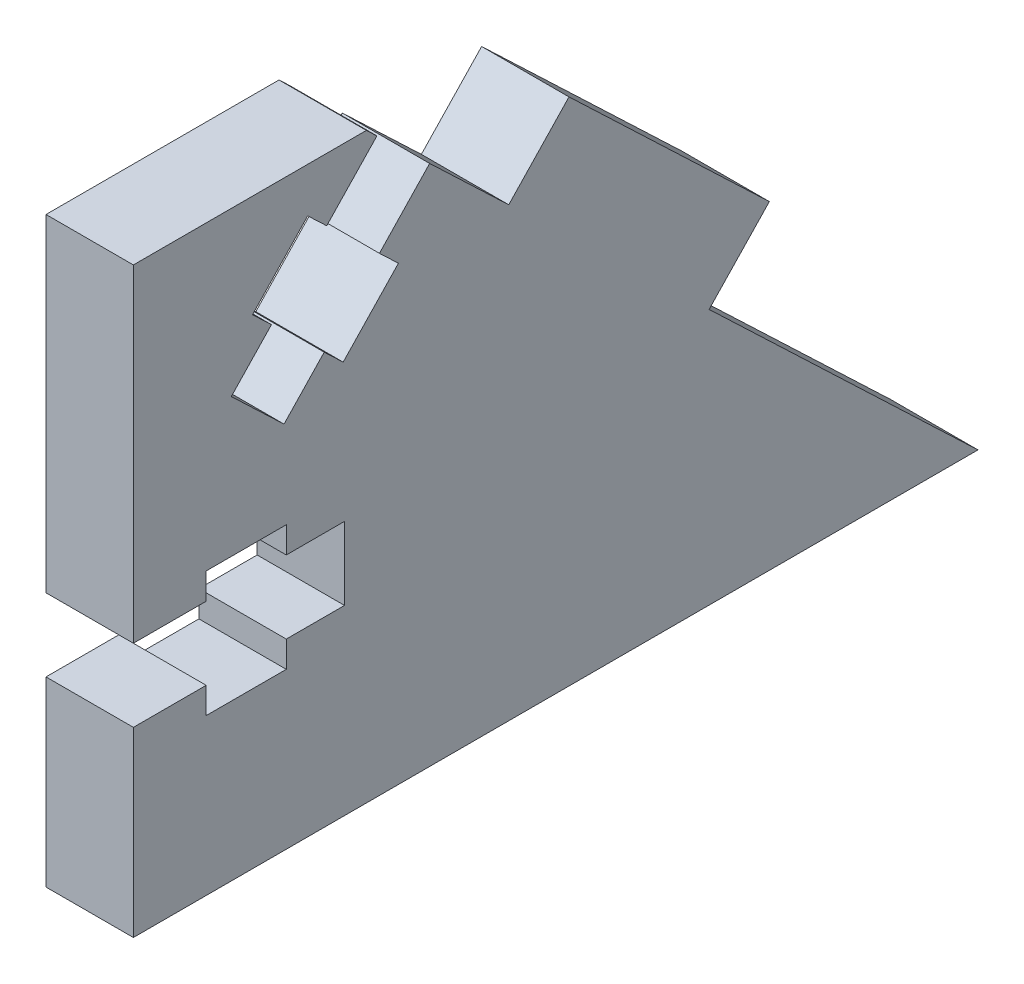
ISO-10303-21;
HEADER;
FILE_DESCRIPTION(('STEP AP214'),'2;1');
FILE_NAME('part.step','',(''),(''),'','','');
FILE_SCHEMA(('AUTOMOTIVE_DESIGN { 1 0 10303 214 1 1 1 1 }'));
ENDSEC;
DATA;
#1=APPLICATION_CONTEXT('core data for automotive mechanical design processes');
#2=APPLICATION_PROTOCOL_DEFINITION('international standard','automotive_design',2000,#1);
#3=PRODUCT_CONTEXT('',#1,'mechanical');
#4=PRODUCT('Part','Part','',(#3));
#5=PRODUCT_RELATED_PRODUCT_CATEGORY('part','',(#4));
#6=PRODUCT_DEFINITION_FORMATION('','',#4);
#7=PRODUCT_DEFINITION_CONTEXT('part definition',#1,'design');
#8=PRODUCT_DEFINITION('design','',#6,#7);
#9=PRODUCT_DEFINITION_SHAPE('','',#8);
#10=(LENGTH_UNIT() NAMED_UNIT(*) SI_UNIT(.MILLI.,.METRE.));
#11=(NAMED_UNIT(*) PLANE_ANGLE_UNIT() SI_UNIT($,.RADIAN.));
#12=(NAMED_UNIT(*) SI_UNIT($,.STERADIAN.) SOLID_ANGLE_UNIT());
#13=UNCERTAINTY_MEASURE_WITH_UNIT(LENGTH_MEASURE(1.E-05),#10,'distance_accuracy_value','');
#14=(GEOMETRIC_REPRESENTATION_CONTEXT(3) GLOBAL_UNCERTAINTY_ASSIGNED_CONTEXT((#13)) GLOBAL_UNIT_ASSIGNED_CONTEXT((#10,
#11,#12)) REPRESENTATION_CONTEXT('',''));
#15=CARTESIAN_POINT('',(0.,0.,0.));
#16=DIRECTION('',(0.,0.,1.));
#17=DIRECTION('',(1.,0.,0.));
#18=AXIS2_PLACEMENT_3D('',#15,#16,#17);
#19=CARTESIAN_POINT('',(6.,0.,0.));
#20=DIRECTION('',(-1.,0.,0.));
#21=DIRECTION('',(0.,0.,1.));
#22=AXIS2_PLACEMENT_3D('',#19,#20,#21);
#23=PLANE('',#22);
#24=DIRECTION('',(0.,-0.724137931034483,0.689655172413792));
#25=VECTOR('',#24,1.);
#26=CARTESIAN_POINT('',(6.,6.8965517241379,7.24137931034481));
#27=LINE('',#26,#25);
#28=CARTESIAN_POINT('',(6.,35.8620689655172,-20.3448275862069));
#29=VERTEX_POINT('',#28);
#30=CARTESIAN_POINT('',(6.,32.2413793103448,-16.8965517241379));
#31=VERTEX_POINT('',#30);
#32=EDGE_CURVE('E248',#29,#31,#27,.T.);
#33=ORIENTED_EDGE('',*,*,#32,.T.);
#34=DIRECTION('',(0.,-0.689655172413792,-0.724137931034484));
#35=VECTOR('',#34,1.);
#36=CARTESIAN_POINT('',(6.,25.3448275862069,-24.1379310344827));
#37=LINE('',#36,#35);
#38=CARTESIAN_POINT('',(6.,31.,-18.2));
#39=VERTEX_POINT('',#38);
#40=EDGE_CURVE('E263',#31,#39,#37,.T.);
#41=ORIENTED_EDGE('',*,*,#40,.T.);
#42=DIRECTION('',(0.,-0.724137931034483,0.689655172413793));
#43=VECTOR('',#42,1.);
#44=CARTESIAN_POINT('',(6.,5.6551724137931,5.93793103448276));
#45=LINE('',#44,#43);
#46=CARTESIAN_POINT('',(6.,27.0172413793103,-14.4068965517241));
#47=VERTEX_POINT('',#46);
#48=EDGE_CURVE('E443',#39,#47,#45,.T.);
#49=ORIENTED_EDGE('',*,*,#48,.T.);
#50=DIRECTION('',(0.,0.689655172413794,0.724137931034482));
#51=VECTOR('',#50,1.);
#52=CARTESIAN_POINT('',(6.,21.3620689655172,-20.3448275862069));
#53=LINE('',#52,#51);
#54=CARTESIAN_POINT('',(6.,28.2586206896552,-13.1034482758621));
#55=VERTEX_POINT('',#54);
#56=EDGE_CURVE('E446',#47,#55,#53,.T.);
#57=ORIENTED_EDGE('',*,*,#56,.T.);
#58=DIRECTION('',(0.,-0.724137931034483,0.689655172413793));
#59=VECTOR('',#58,1.);
#60=CARTESIAN_POINT('',(6.,6.89655172413792,7.24137931034482));
#61=LINE('',#60,#59);
#62=CARTESIAN_POINT('',(6.,25.3620689655172,-10.3448275862069));
#63=VERTEX_POINT('',#62);
#64=EDGE_CURVE('E449',#55,#63,#61,.T.);
#65=ORIENTED_EDGE('',*,*,#64,.T.);
#66=DIRECTION('',(0.,-0.689655172413793,-0.724137931034483));
#67=VECTOR('',#66,1.);
#68=CARTESIAN_POINT('',(6.,18.4655172413793,-17.5862068965517));
#69=LINE('',#68,#67);
#70=CARTESIAN_POINT('',(6.,28.8103448275862,-6.72413793103447));
#71=VERTEX_POINT('',#70);
#72=EDGE_CURVE('E452',#71,#63,#69,.T.);
#73=ORIENTED_EDGE('',*,*,#72,.F.);
#74=DIRECTION('',(0.,-0.724137931034483,0.689655172413793));
#75=VECTOR('',#74,1.);
#76=CARTESIAN_POINT('',(6.,10.3448275862069,10.8620689655172));
#77=LINE('',#76,#75);
#78=CARTESIAN_POINT('',(6.,31.7068965517241,-9.48275862068965));
#79=VERTEX_POINT('',#78);
#80=EDGE_CURVE('E455',#79,#71,#77,.T.);
#81=ORIENTED_EDGE('',*,*,#80,.F.);
#82=DIRECTION('',(0.,-0.689655172413793,-0.724137931034483));
#83=VECTOR('',#82,1.);
#84=CARTESIAN_POINT('',(6.,21.3620689655173,-20.3448275862069));
#85=LINE('',#84,#83);
#86=CARTESIAN_POINT('',(6.,32.948275862069,-8.17931034482758));
#87=VERTEX_POINT('',#86);
#88=EDGE_CURVE('E458',#87,#79,#85,.T.);
#89=ORIENTED_EDGE('',*,*,#88,.F.);
#90=DIRECTION('',(0.,-0.724137931034483,0.689655172413793));
#91=VECTOR('',#90,1.);
#92=CARTESIAN_POINT('',(6.,11.5862068965517,12.1655172413793));
#93=LINE('',#92,#91);
#94=CARTESIAN_POINT('',(6.,36.9310344827586,-11.9724137931034));
#95=VERTEX_POINT('',#94);
#96=EDGE_CURVE('E461',#95,#87,#93,.T.);
#97=ORIENTED_EDGE('',*,*,#96,.F.);
#98=DIRECTION('',(0.,0.689655172413793,0.724137931034483));
#99=VECTOR('',#98,1.);
#100=CARTESIAN_POINT('',(6.,25.3448275862069,-24.1379310344828));
#101=LINE('',#100,#99);
#102=CARTESIAN_POINT('',(6.,35.6896551724138,-13.2758620689655));
#103=VERTEX_POINT('',#102);
#104=EDGE_CURVE('E464',#103,#95,#101,.T.);
#105=ORIENTED_EDGE('',*,*,#104,.F.);
#106=DIRECTION('',(0.,-0.724137931034483,0.689655172413793));
#107=VECTOR('',#106,1.);
#108=CARTESIAN_POINT('',(6.,10.3448275862069,10.8620689655172));
#109=LINE('',#108,#107);
#110=CARTESIAN_POINT('',(6.,39.3103448275862,-16.7241379310345));
#111=VERTEX_POINT('',#110);
#112=EDGE_CURVE('E467',#111,#103,#109,.T.);
#113=ORIENTED_EDGE('',*,*,#112,.F.);
#114=DIRECTION('',(0.,0.689655172413793,0.724137931034483));
#115=VECTOR('',#114,1.);
#116=CARTESIAN_POINT('',(6.,40.,-16.));
#117=LINE('',#116,#115);
#118=CARTESIAN_POINT('',(6.,40.,-16.));
#119=VERTEX_POINT('',#118);
#120=EDGE_CURVE('E326',#111,#119,#117,.T.);
#121=ORIENTED_EDGE('',*,*,#120,.T.);
#122=DIRECTION('',(0.,0.,1.));
#123=VECTOR('',#122,1.);
#124=CARTESIAN_POINT('',(6.,40.,0.));
#125=LINE('',#124,#123);
#126=CARTESIAN_POINT('',(6.,40.,0.));
#127=VERTEX_POINT('',#126);
#128=EDGE_CURVE('E322',#119,#127,#125,.T.);
#129=ORIENTED_EDGE('',*,*,#128,.T.);
#130=DIRECTION('',(0.,-1.,0.));
#131=VECTOR('',#130,1.);
#132=CARTESIAN_POINT('',(6.,0.,0.));
#133=LINE('',#132,#131);
#134=CARTESIAN_POINT('',(6.,17.5,0.));
#135=VERTEX_POINT('',#134);
#136=EDGE_CURVE('E286',#127,#135,#133,.T.);
#137=ORIENTED_EDGE('',*,*,#136,.T.);
#138=DIRECTION('',(0.,0.,-1.));
#139=VECTOR('',#138,1.);
#140=CARTESIAN_POINT('',(6.,17.5,0.));
#141=LINE('',#140,#139);
#142=CARTESIAN_POINT('',(6.,17.5,-5.));
#143=VERTEX_POINT('',#142);
#144=EDGE_CURVE('E393',#135,#143,#141,.T.);
#145=ORIENTED_EDGE('',*,*,#144,.T.);
#146=DIRECTION('',(0.,1.,0.));
#147=VECTOR('',#146,1.);
#148=CARTESIAN_POINT('',(6.,0.,-4.99999999999999));
#149=LINE('',#148,#147);
#150=CARTESIAN_POINT('',(6.,19.3,-5.));
#151=VERTEX_POINT('',#150);
#152=EDGE_CURVE('E362',#143,#151,#149,.T.);
#153=ORIENTED_EDGE('',*,*,#152,.T.);
#154=DIRECTION('',(0.,0.,-1.));
#155=VECTOR('',#154,1.);
#156=CARTESIAN_POINT('',(6.,19.3,0.));
#157=LINE('',#156,#155);
#158=CARTESIAN_POINT('',(6.,19.3,-10.5));
#159=VERTEX_POINT('',#158);
#160=EDGE_CURVE('E366',#151,#159,#157,.T.);
#161=ORIENTED_EDGE('',*,*,#160,.T.);
#162=DIRECTION('',(0.,-1.,0.));
#163=VECTOR('',#162,1.);
#164=CARTESIAN_POINT('',(6.,0.,-10.5));
#165=LINE('',#164,#163);
#166=CARTESIAN_POINT('',(6.,17.5,-10.5));
#167=VERTEX_POINT('',#166);
#168=EDGE_CURVE('E369',#159,#167,#165,.T.);
#169=ORIENTED_EDGE('',*,*,#168,.T.);
#170=DIRECTION('',(0.,0.,-1.));
#171=VECTOR('',#170,1.);
#172=CARTESIAN_POINT('',(6.,17.5,0.));
#173=LINE('',#172,#171);
#174=CARTESIAN_POINT('',(6.,17.5,-14.5));
#175=VERTEX_POINT('',#174);
#176=EDGE_CURVE('E372',#167,#175,#173,.T.);
#177=ORIENTED_EDGE('',*,*,#176,.T.);
#178=DIRECTION('',(0.,1.,0.));
#179=VECTOR('',#178,1.);
#180=CARTESIAN_POINT('',(6.,0.,-14.5));
#181=LINE('',#180,#179);
#182=CARTESIAN_POINT('',(6.,12.5,-14.5));
#183=VERTEX_POINT('',#182);
#184=EDGE_CURVE('E375',#183,#175,#181,.T.);
#185=ORIENTED_EDGE('',*,*,#184,.F.);
#186=DIRECTION('',(0.,0.,-1.));
#187=VECTOR('',#186,1.);
#188=CARTESIAN_POINT('',(6.,12.5,0.));
#189=LINE('',#188,#187);
#190=CARTESIAN_POINT('',(6.,12.5,-10.5));
#191=VERTEX_POINT('',#190);
#192=EDGE_CURVE('E378',#191,#183,#189,.T.);
#193=ORIENTED_EDGE('',*,*,#192,.F.);
#194=DIRECTION('',(0.,1.,0.));
#195=VECTOR('',#194,1.);
#196=CARTESIAN_POINT('',(6.,0.,-10.5));
#197=LINE('',#196,#195);
#198=CARTESIAN_POINT('',(6.,10.7,-10.5));
#199=VERTEX_POINT('',#198);
#200=EDGE_CURVE('E381',#199,#191,#197,.T.);
#201=ORIENTED_EDGE('',*,*,#200,.F.);
#202=DIRECTION('',(0.,0.,-1.));
#203=VECTOR('',#202,1.);
#204=CARTESIAN_POINT('',(6.,10.7,0.));
#205=LINE('',#204,#203);
#206=CARTESIAN_POINT('',(6.,10.7,-4.99999999999999));
#207=VERTEX_POINT('',#206);
#208=EDGE_CURVE('E384',#207,#199,#205,.T.);
#209=ORIENTED_EDGE('',*,*,#208,.F.);
#210=DIRECTION('',(0.,-1.,0.));
#211=VECTOR('',#210,1.);
#212=CARTESIAN_POINT('',(6.,0.,-4.99999999999999));
#213=LINE('',#212,#211);
#214=CARTESIAN_POINT('',(6.,12.5,-5.));
#215=VERTEX_POINT('',#214);
#216=EDGE_CURVE('E387',#215,#207,#213,.T.);
#217=ORIENTED_EDGE('',*,*,#216,.F.);
#218=DIRECTION('',(0.,0.,-1.));
#219=VECTOR('',#218,1.);
#220=CARTESIAN_POINT('',(6.,12.5,0.));
#221=LINE('',#220,#219);
#222=CARTESIAN_POINT('',(6.,12.5,0.));
#223=VERTEX_POINT('',#222);
#224=EDGE_CURVE('E390',#223,#215,#221,.T.);
#225=ORIENTED_EDGE('',*,*,#224,.F.);
#226=CARTESIAN_POINT('',(6.,0.,0.));
#227=VERTEX_POINT('',#226);
#228=EDGE_CURVE('E321',#223,#227,#133,.T.);
#229=ORIENTED_EDGE('',*,*,#228,.T.);
#230=DIRECTION('',(0.,0.,-1.));
#231=VECTOR('',#230,1.);
#232=CARTESIAN_POINT('',(6.,0.,-58.));
#233=LINE('',#232,#231);
#234=CARTESIAN_POINT('',(6.,0.,-58.));
#235=VERTEX_POINT('',#234);
#236=EDGE_CURVE('E281',#227,#235,#233,.T.);
#237=ORIENTED_EDGE('',*,*,#236,.T.);
#238=DIRECTION('',(0.,0.689655172413794,0.724137931034482));
#239=VECTOR('',#238,1.);
#240=CARTESIAN_POINT('',(6.,17.5862068965517,-39.5344827586207));
#241=LINE('',#240,#239);
#242=CARTESIAN_POINT('',(6.,17.5862068965517,-39.5344827586207));
#243=VERTEX_POINT('',#242);
#244=EDGE_CURVE('E332',#235,#243,#241,.T.);
#245=ORIENTED_EDGE('',*,*,#244,.T.);
#246=DIRECTION('',(0.,0.724137931034483,-0.689655172413793));
#247=VECTOR('',#246,1.);
#248=CARTESIAN_POINT('',(6.,21.9310344827586,-43.6724137931035));
#249=LINE('',#248,#247);
#250=CARTESIAN_POINT('',(6.,21.9310344827586,-43.6724137931035));
#251=VERTEX_POINT('',#250);
#252=EDGE_CURVE('E306',#243,#251,#249,.T.);
#253=ORIENTED_EDGE('',*,*,#252,.T.);
#254=DIRECTION('',(0.,0.689655172413793,0.724137931034483));
#255=VECTOR('',#254,1.);
#256=CARTESIAN_POINT('',(6.,35.0344827586207,-29.9137931034483));
#257=LINE('',#256,#255);
#258=CARTESIAN_POINT('',(6.,35.0344827586207,-29.9137931034483));
#259=VERTEX_POINT('',#258);
#260=EDGE_CURVE('E329',#251,#259,#257,.T.);
#261=ORIENTED_EDGE('',*,*,#260,.T.);
#262=DIRECTION('',(0.,-0.724137931034483,0.689655172413792));
#263=VECTOR('',#262,1.);
#264=CARTESIAN_POINT('',(6.,30.6896551724138,-25.7758620689655));
#265=LINE('',#264,#263);
#266=CARTESIAN_POINT('',(6.,30.6896551724138,-25.7758620689655));
#267=VERTEX_POINT('',#266);
#268=EDGE_CURVE('E327',#259,#267,#265,.T.);
#269=ORIENTED_EDGE('',*,*,#268,.T.);
#270=EDGE_CURVE('E324',#267,#29,#117,.T.);
#271=ORIENTED_EDGE('',*,*,#270,.T.);
#272=EDGE_LOOP('',(#33,#41,#49,#57,#65,#73,#81,#89,#97,#105,#113,#121,#129,#137,#145,#153,#161,
#169,#177,#185,#193,#201,#209,#217,#225,#229,#237,#245,#253,#261,#269,#271));
#273=FACE_BOUND('',#272,.T.);
#274=ADVANCED_FACE('F33',(#273),#23,.F.);
#275=CARTESIAN_POINT('',(0.,0.,0.));
#276=DIRECTION('',(-1.,0.,0.));
#277=DIRECTION('',(0.,0.,1.));
#278=AXIS2_PLACEMENT_3D('',#275,#276,#277);
#279=PLANE('',#278);
#280=DIRECTION('',(0.,-0.689655172413792,-0.724137931034484));
#281=VECTOR('',#280,1.);
#282=CARTESIAN_POINT('',(0.,25.3448275862069,-24.1379310344827));
#283=LINE('',#282,#281);
#284=CARTESIAN_POINT('',(0.,32.2413793103448,-16.8965517241379));
#285=VERTEX_POINT('',#284);
#286=CARTESIAN_POINT('',(0.,31.,-18.2));
#287=VERTEX_POINT('',#286);
#288=EDGE_CURVE('E254',#285,#287,#283,.T.);
#289=ORIENTED_EDGE('',*,*,#288,.F.);
#290=DIRECTION('',(0.,-0.724137931034483,0.689655172413792));
#291=VECTOR('',#290,1.);
#292=CARTESIAN_POINT('',(0.,6.8965517241379,7.24137931034481));
#293=LINE('',#292,#291);
#294=CARTESIAN_POINT('',(0.,35.8620689655172,-20.3448275862069));
#295=VERTEX_POINT('',#294);
#296=EDGE_CURVE('E245',#295,#285,#293,.T.);
#297=ORIENTED_EDGE('',*,*,#296,.F.);
#298=DIRECTION('',(0.,0.689655172413793,0.724137931034483));
#299=VECTOR('',#298,1.);
#300=CARTESIAN_POINT('',(0.,40.,-16.));
#301=LINE('',#300,#299);
#302=CARTESIAN_POINT('',(0.,30.6896551724138,-25.7758620689655));
#303=VERTEX_POINT('',#302);
#304=EDGE_CURVE('E261',#303,#295,#301,.T.);
#305=ORIENTED_EDGE('',*,*,#304,.F.);
#306=DIRECTION('',(0.,-0.724137931034483,0.689655172413792));
#307=VECTOR('',#306,1.);
#308=CARTESIAN_POINT('',(0.,30.6896551724138,-25.7758620689655));
#309=LINE('',#308,#307);
#310=CARTESIAN_POINT('',(0.,35.0344827586207,-29.9137931034483));
#311=VERTEX_POINT('',#310);
#312=EDGE_CURVE('E274',#311,#303,#309,.T.);
#313=ORIENTED_EDGE('',*,*,#312,.F.);
#314=DIRECTION('',(0.,0.689655172413793,0.724137931034483));
#315=VECTOR('',#314,1.);
#316=CARTESIAN_POINT('',(0.,35.0344827586207,-29.9137931034483));
#317=LINE('',#316,#315);
#318=CARTESIAN_POINT('',(0.,21.9310344827586,-43.6724137931035));
#319=VERTEX_POINT('',#318);
#320=EDGE_CURVE('E311',#319,#311,#317,.T.);
#321=ORIENTED_EDGE('',*,*,#320,.F.);
#322=DIRECTION('',(0.,0.724137931034483,-0.689655172413793));
#323=VECTOR('',#322,1.);
#324=CARTESIAN_POINT('',(0.,21.9310344827586,-43.6724137931035));
#325=LINE('',#324,#323);
#326=CARTESIAN_POINT('',(0.,17.5862068965517,-39.5344827586207));
#327=VERTEX_POINT('',#326);
#328=EDGE_CURVE('E305',#327,#319,#325,.T.);
#329=ORIENTED_EDGE('',*,*,#328,.F.);
#330=DIRECTION('',(0.,0.689655172413794,0.724137931034482));
#331=VECTOR('',#330,1.);
#332=CARTESIAN_POINT('',(0.,17.5862068965517,-39.5344827586207));
#333=LINE('',#332,#331);
#334=CARTESIAN_POINT('',(0.,0.,-58.));
#335=VERTEX_POINT('',#334);
#336=EDGE_CURVE('E310',#335,#327,#333,.T.);
#337=ORIENTED_EDGE('',*,*,#336,.F.);
#338=DIRECTION('',(0.,0.,-1.));
#339=VECTOR('',#338,1.);
#340=CARTESIAN_POINT('',(0.,0.,-58.));
#341=LINE('',#340,#339);
#342=CARTESIAN_POINT('',(0.,0.,0.));
#343=VERTEX_POINT('',#342);
#344=EDGE_CURVE('E313',#343,#335,#341,.T.);
#345=ORIENTED_EDGE('',*,*,#344,.F.);
#346=DIRECTION('',(0.,-1.,0.));
#347=VECTOR('',#346,1.);
#348=CARTESIAN_POINT('',(0.,0.,0.));
#349=LINE('',#348,#347);
#350=CARTESIAN_POINT('',(0.,12.5,0.));
#351=VERTEX_POINT('',#350);
#352=EDGE_CURVE('E272',#351,#343,#349,.T.);
#353=ORIENTED_EDGE('',*,*,#352,.F.);
#354=DIRECTION('',(0.,0.,-1.));
#355=VECTOR('',#354,1.);
#356=CARTESIAN_POINT('',(0.,12.5,0.));
#357=LINE('',#356,#355);
#358=CARTESIAN_POINT('',(0.,12.5,-5.));
#359=VERTEX_POINT('',#358);
#360=EDGE_CURVE('E417',#351,#359,#357,.T.);
#361=ORIENTED_EDGE('',*,*,#360,.T.);
#362=DIRECTION('',(0.,-1.,0.));
#363=VECTOR('',#362,1.);
#364=CARTESIAN_POINT('',(0.,0.,-4.99999999999999));
#365=LINE('',#364,#363);
#366=CARTESIAN_POINT('',(0.,10.7,-4.99999999999999));
#367=VERTEX_POINT('',#366);
#368=EDGE_CURVE('E56',#359,#367,#365,.T.);
#369=ORIENTED_EDGE('',*,*,#368,.T.);
#370=DIRECTION('',(0.,0.,-1.));
#371=VECTOR('',#370,1.);
#372=CARTESIAN_POINT('',(0.,10.7,0.));
#373=LINE('',#372,#371);
#374=CARTESIAN_POINT('',(0.,10.7,-10.5));
#375=VERTEX_POINT('',#374);
#376=EDGE_CURVE('E413',#367,#375,#373,.T.);
#377=ORIENTED_EDGE('',*,*,#376,.T.);
#378=DIRECTION('',(0.,1.,0.));
#379=VECTOR('',#378,1.);
#380=CARTESIAN_POINT('',(0.,0.,-10.5));
#381=LINE('',#380,#379);
#382=CARTESIAN_POINT('',(0.,12.5,-10.5));
#383=VERTEX_POINT('',#382);
#384=EDGE_CURVE('E410',#375,#383,#381,.T.);
#385=ORIENTED_EDGE('',*,*,#384,.T.);
#386=DIRECTION('',(0.,0.,-1.));
#387=VECTOR('',#386,1.);
#388=CARTESIAN_POINT('',(0.,12.5,0.));
#389=LINE('',#388,#387);
#390=CARTESIAN_POINT('',(0.,12.5,-14.5));
#391=VERTEX_POINT('',#390);
#392=EDGE_CURVE('E407',#383,#391,#389,.T.);
#393=ORIENTED_EDGE('',*,*,#392,.T.);
#394=DIRECTION('',(0.,1.,0.));
#395=VECTOR('',#394,1.);
#396=CARTESIAN_POINT('',(0.,0.,-14.5));
#397=LINE('',#396,#395);
#398=CARTESIAN_POINT('',(0.,17.5,-14.5));
#399=VERTEX_POINT('',#398);
#400=EDGE_CURVE('E404',#391,#399,#397,.T.);
#401=ORIENTED_EDGE('',*,*,#400,.T.);
#402=DIRECTION('',(0.,0.,-1.));
#403=VECTOR('',#402,1.);
#404=CARTESIAN_POINT('',(0.,17.5,0.));
#405=LINE('',#404,#403);
#406=CARTESIAN_POINT('',(0.,17.5,-10.5));
#407=VERTEX_POINT('',#406);
#408=EDGE_CURVE('E402',#407,#399,#405,.T.);
#409=ORIENTED_EDGE('',*,*,#408,.F.);
#410=DIRECTION('',(0.,-1.,0.));
#411=VECTOR('',#410,1.);
#412=CARTESIAN_POINT('',(0.,0.,-10.5));
#413=LINE('',#412,#411);
#414=CARTESIAN_POINT('',(0.,19.3,-10.5));
#415=VERTEX_POINT('',#414);
#416=EDGE_CURVE('E400',#415,#407,#413,.T.);
#417=ORIENTED_EDGE('',*,*,#416,.F.);
#418=DIRECTION('',(0.,0.,-1.));
#419=VECTOR('',#418,1.);
#420=CARTESIAN_POINT('',(0.,19.3,0.));
#421=LINE('',#420,#419);
#422=CARTESIAN_POINT('',(0.,19.3,-5.));
#423=VERTEX_POINT('',#422);
#424=EDGE_CURVE('E398',#423,#415,#421,.T.);
#425=ORIENTED_EDGE('',*,*,#424,.F.);
#426=DIRECTION('',(0.,1.,0.));
#427=VECTOR('',#426,1.);
#428=CARTESIAN_POINT('',(0.,0.,-4.99999999999999));
#429=LINE('',#428,#427);
#430=CARTESIAN_POINT('',(0.,17.5,-5.));
#431=VERTEX_POINT('',#430);
#432=EDGE_CURVE('E340',#431,#423,#429,.T.);
#433=ORIENTED_EDGE('',*,*,#432,.F.);
#434=DIRECTION('',(0.,0.,-1.));
#435=VECTOR('',#434,1.);
#436=CARTESIAN_POINT('',(0.,17.5,0.));
#437=LINE('',#436,#435);
#438=CARTESIAN_POINT('',(0.,17.5,0.));
#439=VERTEX_POINT('',#438);
#440=EDGE_CURVE('E365',#439,#431,#437,.T.);
#441=ORIENTED_EDGE('',*,*,#440,.F.);
#442=CARTESIAN_POINT('',(0.,40.,0.));
#443=VERTEX_POINT('',#442);
#444=EDGE_CURVE('E278',#443,#439,#349,.T.);
#445=ORIENTED_EDGE('',*,*,#444,.F.);
#446=DIRECTION('',(0.,0.,1.));
#447=VECTOR('',#446,1.);
#448=CARTESIAN_POINT('',(0.,40.,0.));
#449=LINE('',#448,#447);
#450=CARTESIAN_POINT('',(0.,40.,-16.));
#451=VERTEX_POINT('',#450);
#452=EDGE_CURVE('E269',#451,#443,#449,.T.);
#453=ORIENTED_EDGE('',*,*,#452,.F.);
#454=CARTESIAN_POINT('',(0.,39.3103448275862,-16.7241379310345));
#455=VERTEX_POINT('',#454);
#456=EDGE_CURVE('E270',#455,#451,#301,.T.);
#457=ORIENTED_EDGE('',*,*,#456,.F.);
#458=DIRECTION('',(0.,-0.724137931034483,0.689655172413793));
#459=VECTOR('',#458,1.);
#460=CARTESIAN_POINT('',(0.,10.3448275862069,10.8620689655172));
#461=LINE('',#460,#459);
#462=CARTESIAN_POINT('',(0.,35.6896551724138,-13.2758620689655));
#463=VERTEX_POINT('',#462);
#464=EDGE_CURVE('E48',#455,#463,#461,.T.);
#465=ORIENTED_EDGE('',*,*,#464,.T.);
#466=DIRECTION('',(0.,0.689655172413793,0.724137931034483));
#467=VECTOR('',#466,1.);
#468=CARTESIAN_POINT('',(0.,25.3448275862069,-24.1379310344828));
#469=LINE('',#468,#467);
#470=CARTESIAN_POINT('',(0.,36.9310344827586,-11.9724137931034));
#471=VERTEX_POINT('',#470);
#472=EDGE_CURVE('E490',#463,#471,#469,.T.);
#473=ORIENTED_EDGE('',*,*,#472,.T.);
#474=DIRECTION('',(0.,-0.724137931034483,0.689655172413793));
#475=VECTOR('',#474,1.);
#476=CARTESIAN_POINT('',(0.,11.5862068965517,12.1655172413793));
#477=LINE('',#476,#475);
#478=CARTESIAN_POINT('',(0.,32.948275862069,-8.17931034482758));
#479=VERTEX_POINT('',#478);
#480=EDGE_CURVE('E487',#471,#479,#477,.T.);
#481=ORIENTED_EDGE('',*,*,#480,.T.);
#482=DIRECTION('',(0.,-0.689655172413793,-0.724137931034483));
#483=VECTOR('',#482,1.);
#484=CARTESIAN_POINT('',(0.,21.3620689655173,-20.3448275862069));
#485=LINE('',#484,#483);
#486=CARTESIAN_POINT('',(0.,31.7068965517241,-9.48275862068965));
#487=VERTEX_POINT('',#486);
#488=EDGE_CURVE('E484',#479,#487,#485,.T.);
#489=ORIENTED_EDGE('',*,*,#488,.T.);
#490=DIRECTION('',(0.,-0.724137931034483,0.689655172413793));
#491=VECTOR('',#490,1.);
#492=CARTESIAN_POINT('',(0.,10.3448275862069,10.8620689655172));
#493=LINE('',#492,#491);
#494=CARTESIAN_POINT('',(0.,28.8103448275862,-6.72413793103447));
#495=VERTEX_POINT('',#494);
#496=EDGE_CURVE('E481',#487,#495,#493,.T.);
#497=ORIENTED_EDGE('',*,*,#496,.T.);
#498=DIRECTION('',(0.,-0.689655172413793,-0.724137931034483));
#499=VECTOR('',#498,1.);
#500=CARTESIAN_POINT('',(0.,18.4655172413793,-17.5862068965517));
#501=LINE('',#500,#499);
#502=CARTESIAN_POINT('',(0.,25.3620689655172,-10.3448275862069));
#503=VERTEX_POINT('',#502);
#504=EDGE_CURVE('E478',#495,#503,#501,.T.);
#505=ORIENTED_EDGE('',*,*,#504,.T.);
#506=DIRECTION('',(0.,-0.724137931034483,0.689655172413793));
#507=VECTOR('',#506,1.);
#508=CARTESIAN_POINT('',(0.,6.89655172413792,7.24137931034482));
#509=LINE('',#508,#507);
#510=CARTESIAN_POINT('',(0.,28.2586206896552,-13.1034482758621));
#511=VERTEX_POINT('',#510);
#512=EDGE_CURVE('E476',#511,#503,#509,.T.);
#513=ORIENTED_EDGE('',*,*,#512,.F.);
#514=DIRECTION('',(0.,0.689655172413794,0.724137931034482));
#515=VECTOR('',#514,1.);
#516=CARTESIAN_POINT('',(0.,21.3620689655172,-20.3448275862069));
#517=LINE('',#516,#515);
#518=CARTESIAN_POINT('',(0.,27.0172413793103,-14.4068965517241));
#519=VERTEX_POINT('',#518);
#520=EDGE_CURVE('E474',#519,#511,#517,.T.);
#521=ORIENTED_EDGE('',*,*,#520,.F.);
#522=DIRECTION('',(0.,-0.724137931034483,0.689655172413793));
#523=VECTOR('',#522,1.);
#524=CARTESIAN_POINT('',(0.,5.6551724137931,5.93793103448276));
#525=LINE('',#524,#523);
#526=EDGE_CURVE('E472',#287,#519,#525,.T.);
#527=ORIENTED_EDGE('',*,*,#526,.F.);
#528=EDGE_LOOP('',(#289,#297,#305,#313,#321,#329,#337,#345,#353,#361,#369,#377,#385,#393,#401,
#409,#417,#425,#433,#441,#445,#453,#457,#465,#473,#481,#489,#497,#505,#513,#521,#527));
#529=FACE_BOUND('',#528,.T.);
#530=ADVANCED_FACE('F259',(#529),#279,.T.);
#531=CARTESIAN_POINT('',(6.,40.,-16.));
#532=DIRECTION('',(0.,-0.724137931034483,0.689655172413793));
#533=DIRECTION('',(0.,-0.689655172413793,-0.724137931034483));
#534=AXIS2_PLACEMENT_3D('',#531,#532,#533);
#535=PLANE('',#534);
#536=DIRECTION('',(1.,0.,0.));
#537=VECTOR('',#536,1.);
#538=CARTESIAN_POINT('',(0.,35.8620689655172,-20.3448275862069));
#539=LINE('',#538,#537);
#540=EDGE_CURVE('E241',#295,#29,#539,.T.);
#541=ORIENTED_EDGE('',*,*,#540,.T.);
#542=ORIENTED_EDGE('',*,*,#270,.F.);
#543=DIRECTION('',(-1.,0.,0.));
#544=VECTOR('',#543,1.);
#545=CARTESIAN_POINT('',(6.,30.6896551724138,-25.7758620689655));
#546=LINE('',#545,#544);
#547=EDGE_CURVE('E268',#267,#303,#546,.T.);
#548=ORIENTED_EDGE('',*,*,#547,.T.);
#549=ORIENTED_EDGE('',*,*,#304,.T.);
#550=EDGE_LOOP('',(#541,#542,#548,#549));
#551=FACE_BOUND('',#550,.T.);
#552=ADVANCED_FACE('F266',(#551),#535,.F.);
#553=CARTESIAN_POINT('',(6.,0.,0.));
#554=DIRECTION('',(0.,0.,-1.));
#555=DIRECTION('',(-1.,0.,0.));
#556=AXIS2_PLACEMENT_3D('',#553,#554,#555);
#557=PLANE('',#556);
#558=DIRECTION('',(1.,0.,0.));
#559=VECTOR('',#558,1.);
#560=CARTESIAN_POINT('',(0.,17.5,0.));
#561=LINE('',#560,#559);
#562=EDGE_CURVE('E336',#439,#135,#561,.T.);
#563=ORIENTED_EDGE('',*,*,#562,.T.);
#564=ORIENTED_EDGE('',*,*,#136,.F.);
#565=DIRECTION('',(-1.,0.,0.));
#566=VECTOR('',#565,1.);
#567=CARTESIAN_POINT('',(6.,40.,0.));
#568=LINE('',#567,#566);
#569=EDGE_CURVE('E285',#127,#443,#568,.T.);
#570=ORIENTED_EDGE('',*,*,#569,.T.);
#571=ORIENTED_EDGE('',*,*,#444,.T.);
#572=EDGE_LOOP('',(#563,#564,#570,#571));
#573=FACE_BOUND('',#572,.T.);
#574=ADVANCED_FACE('F575',(#573),#557,.F.);
#575=CARTESIAN_POINT('',(6.,0.,-58.));
#576=DIRECTION('',(0.,1.,0.));
#577=DIRECTION('',(0.,0.,1.));
#578=AXIS2_PLACEMENT_3D('',#575,#576,#577);
#579=PLANE('',#578);
#580=ORIENTED_EDGE('',*,*,#344,.T.);
#581=DIRECTION('',(-1.,0.,0.));
#582=VECTOR('',#581,1.);
#583=CARTESIAN_POINT('',(6.,0.,-58.));
#584=LINE('',#583,#582);
#585=EDGE_CURVE('E11',#235,#335,#584,.T.);
#586=ORIENTED_EDGE('',*,*,#585,.F.);
#587=ORIENTED_EDGE('',*,*,#236,.F.);
#588=DIRECTION('',(-1.,0.,0.));
#589=VECTOR('',#588,1.);
#590=CARTESIAN_POINT('',(6.,0.,0.));
#591=LINE('',#590,#589);
#592=EDGE_CURVE('E282',#227,#343,#591,.T.);
#593=ORIENTED_EDGE('',*,*,#592,.T.);
#594=EDGE_LOOP('',(#580,#586,#587,#593));
#595=FACE_BOUND('',#594,.T.);
#596=ADVANCED_FACE('F35',(#595),#579,.F.);
#597=CARTESIAN_POINT('',(6.,17.5862068965517,-39.5344827586207));
#598=DIRECTION('',(0.,-0.724137931034482,0.689655172413794));
#599=DIRECTION('',(0.,-0.689655172413794,-0.724137931034482));
#600=AXIS2_PLACEMENT_3D('',#597,#598,#599);
#601=PLANE('',#600);
#602=ORIENTED_EDGE('',*,*,#336,.T.);
#603=DIRECTION('',(-1.,0.,0.));
#604=VECTOR('',#603,1.);
#605=CARTESIAN_POINT('',(6.,17.5862068965517,-39.5344827586207));
#606=LINE('',#605,#604);
#607=EDGE_CURVE('E41',#243,#327,#606,.T.);
#608=ORIENTED_EDGE('',*,*,#607,.F.);
#609=ORIENTED_EDGE('',*,*,#244,.F.);
#610=ORIENTED_EDGE('',*,*,#585,.T.);
#611=EDGE_LOOP('',(#602,#608,#609,#610));
#612=FACE_BOUND('',#611,.T.);
#613=ADVANCED_FACE('F559',(#612),#601,.F.);
#614=CARTESIAN_POINT('',(6.,21.9310344827586,-43.6724137931035));
#615=DIRECTION('',(0.,0.689655172413793,0.724137931034483));
#616=DIRECTION('',(0.,-0.724137931034483,0.689655172413793));
#617=AXIS2_PLACEMENT_3D('',#614,#615,#616);
#618=PLANE('',#617);
#619=ORIENTED_EDGE('',*,*,#328,.T.);
#620=DIRECTION('',(-1.,0.,0.));
#621=VECTOR('',#620,1.);
#622=CARTESIAN_POINT('',(6.,21.9310344827586,-43.6724137931035));
#623=LINE('',#622,#621);
#624=EDGE_CURVE('E296',#251,#319,#623,.T.);
#625=ORIENTED_EDGE('',*,*,#624,.F.);
#626=ORIENTED_EDGE('',*,*,#252,.F.);
#627=ORIENTED_EDGE('',*,*,#607,.T.);
#628=EDGE_LOOP('',(#619,#625,#626,#627));
#629=FACE_BOUND('',#628,.T.);
#630=ADVANCED_FACE('F303',(#629),#618,.F.);
#631=CARTESIAN_POINT('',(6.,35.0344827586207,-29.9137931034483));
#632=DIRECTION('',(0.,-0.724137931034483,0.689655172413793));
#633=DIRECTION('',(0.,-0.689655172413793,-0.724137931034483));
#634=AXIS2_PLACEMENT_3D('',#631,#632,#633);
#635=PLANE('',#634);
#636=ORIENTED_EDGE('',*,*,#320,.T.);
#637=DIRECTION('',(-1.,0.,0.));
#638=VECTOR('',#637,1.);
#639=CARTESIAN_POINT('',(6.,35.0344827586207,-29.9137931034483));
#640=LINE('',#639,#638);
#641=EDGE_CURVE('E293',#259,#311,#640,.T.);
#642=ORIENTED_EDGE('',*,*,#641,.F.);
#643=ORIENTED_EDGE('',*,*,#260,.F.);
#644=ORIENTED_EDGE('',*,*,#624,.T.);
#645=EDGE_LOOP('',(#636,#642,#643,#644));
#646=FACE_BOUND('',#645,.T.);
#647=ADVANCED_FACE('F551',(#646),#635,.F.);
#648=CARTESIAN_POINT('',(6.,30.6896551724138,-25.7758620689655));
#649=DIRECTION('',(0.,-0.689655172413792,-0.724137931034484));
#650=DIRECTION('',(0.,0.724137931034483,-0.689655172413792));
#651=AXIS2_PLACEMENT_3D('',#648,#649,#650);
#652=PLANE('',#651);
#653=ORIENTED_EDGE('',*,*,#312,.T.);
#654=ORIENTED_EDGE('',*,*,#547,.F.);
#655=ORIENTED_EDGE('',*,*,#268,.F.);
#656=ORIENTED_EDGE('',*,*,#641,.T.);
#657=EDGE_LOOP('',(#653,#654,#655,#656));
#658=FACE_BOUND('',#657,.T.);
#659=ADVANCED_FACE('F549',(#658),#652,.F.);
#660=ORIENTED_EDGE('',*,*,#120,.F.);
#661=DIRECTION('',(1.,0.,0.));
#662=VECTOR('',#661,1.);
#663=CARTESIAN_POINT('',(0.,39.3103448275862,-16.7241379310345));
#664=LINE('',#663,#662);
#665=EDGE_CURVE('E253',#455,#111,#664,.T.);
#666=ORIENTED_EDGE('',*,*,#665,.F.);
#667=ORIENTED_EDGE('',*,*,#456,.T.);
#668=DIRECTION('',(-1.,0.,0.));
#669=VECTOR('',#668,1.);
#670=CARTESIAN_POINT('',(6.,40.,-16.));
#671=LINE('',#670,#669);
#672=EDGE_CURVE('E289',#119,#451,#671,.T.);
#673=ORIENTED_EDGE('',*,*,#672,.F.);
#674=EDGE_LOOP('',(#660,#666,#667,#673));
#675=FACE_BOUND('',#674,.T.);
#676=ADVANCED_FACE('F500',(#675),#535,.F.);
#677=CARTESIAN_POINT('',(6.,40.,0.));
#678=DIRECTION('',(0.,-1.,0.));
#679=DIRECTION('',(0.,0.,-1.));
#680=AXIS2_PLACEMENT_3D('',#677,#678,#679);
#681=PLANE('',#680);
#682=ORIENTED_EDGE('',*,*,#452,.T.);
#683=ORIENTED_EDGE('',*,*,#569,.F.);
#684=ORIENTED_EDGE('',*,*,#128,.F.);
#685=ORIENTED_EDGE('',*,*,#672,.T.);
#686=EDGE_LOOP('',(#682,#683,#684,#685));
#687=FACE_BOUND('',#686,.T.);
#688=ADVANCED_FACE('F503',(#687),#681,.F.);
#689=ORIENTED_EDGE('',*,*,#228,.F.);
#690=DIRECTION('',(1.,0.,0.));
#691=VECTOR('',#690,1.);
#692=CARTESIAN_POINT('',(0.,12.5,0.));
#693=LINE('',#692,#691);
#694=EDGE_CURVE('E339',#351,#223,#693,.T.);
#695=ORIENTED_EDGE('',*,*,#694,.F.);
#696=ORIENTED_EDGE('',*,*,#352,.T.);
#697=ORIENTED_EDGE('',*,*,#592,.F.);
#698=EDGE_LOOP('',(#689,#695,#696,#697));
#699=FACE_BOUND('',#698,.T.);
#700=ADVANCED_FACE('F571',(#699),#557,.F.);
#701=CARTESIAN_POINT('',(0.,17.5,0.));
#702=DIRECTION('',(0.,-1.,0.));
#703=DIRECTION('',(0.,0.,-1.));
#704=AXIS2_PLACEMENT_3D('',#701,#702,#703);
#705=PLANE('',#704);
#706=ORIENTED_EDGE('',*,*,#144,.F.);
#707=ORIENTED_EDGE('',*,*,#562,.F.);
#708=ORIENTED_EDGE('',*,*,#440,.T.);
#709=DIRECTION('',(1.,0.,0.));
#710=VECTOR('',#709,1.);
#711=CARTESIAN_POINT('',(0.,17.5,-5.));
#712=LINE('',#711,#710);
#713=EDGE_CURVE('E318',#431,#143,#712,.T.);
#714=ORIENTED_EDGE('',*,*,#713,.T.);
#715=EDGE_LOOP('',(#706,#707,#708,#714));
#716=FACE_BOUND('',#715,.T.);
#717=ADVANCED_FACE('F568',(#716),#705,.T.);
#718=CARTESIAN_POINT('',(0.,0.,-4.99999999999999));
#719=DIRECTION('',(0.,0.,-1.));
#720=DIRECTION('',(0.,1.,0.));
#721=AXIS2_PLACEMENT_3D('',#718,#719,#720);
#722=PLANE('',#721);
#723=ORIENTED_EDGE('',*,*,#152,.F.);
#724=ORIENTED_EDGE('',*,*,#713,.F.);
#725=ORIENTED_EDGE('',*,*,#432,.T.);
#726=DIRECTION('',(1.,0.,0.));
#727=VECTOR('',#726,1.);
#728=CARTESIAN_POINT('',(0.,19.3,-5.));
#729=LINE('',#728,#727);
#730=EDGE_CURVE('E358',#423,#151,#729,.T.);
#731=ORIENTED_EDGE('',*,*,#730,.T.);
#732=EDGE_LOOP('',(#723,#724,#725,#731));
#733=FACE_BOUND('',#732,.T.);
#734=ADVANCED_FACE('F598',(#733),#722,.T.);
#735=CARTESIAN_POINT('',(0.,19.3,0.));
#736=DIRECTION('',(0.,-1.,0.));
#737=DIRECTION('',(0.,0.,-1.));
#738=AXIS2_PLACEMENT_3D('',#735,#736,#737);
#739=PLANE('',#738);
#740=ORIENTED_EDGE('',*,*,#160,.F.);
#741=ORIENTED_EDGE('',*,*,#730,.F.);
#742=ORIENTED_EDGE('',*,*,#424,.T.);
#743=DIRECTION('',(1.,0.,0.));
#744=VECTOR('',#743,1.);
#745=CARTESIAN_POINT('',(0.,19.3,-10.5));
#746=LINE('',#745,#744);
#747=EDGE_CURVE('E356',#415,#159,#746,.T.);
#748=ORIENTED_EDGE('',*,*,#747,.T.);
#749=EDGE_LOOP('',(#740,#741,#742,#748));
#750=FACE_BOUND('',#749,.T.);
#751=ADVANCED_FACE('F601',(#750),#739,.T.);
#752=CARTESIAN_POINT('',(0.,0.,-10.5));
#753=DIRECTION('',(0.,0.,1.));
#754=DIRECTION('',(1.,0.,0.));
#755=AXIS2_PLACEMENT_3D('',#752,#753,#754);
#756=PLANE('',#755);
#757=ORIENTED_EDGE('',*,*,#168,.F.);
#758=ORIENTED_EDGE('',*,*,#747,.F.);
#759=ORIENTED_EDGE('',*,*,#416,.T.);
#760=DIRECTION('',(1.,0.,0.));
#761=VECTOR('',#760,1.);
#762=CARTESIAN_POINT('',(0.,17.5,-10.5));
#763=LINE('',#762,#761);
#764=EDGE_CURVE('E354',#407,#167,#763,.T.);
#765=ORIENTED_EDGE('',*,*,#764,.T.);
#766=EDGE_LOOP('',(#757,#758,#759,#765));
#767=FACE_BOUND('',#766,.T.);
#768=ADVANCED_FACE('F607',(#767),#756,.T.);
#769=CARTESIAN_POINT('',(0.,17.5,0.));
#770=DIRECTION('',(0.,-1.,0.));
#771=DIRECTION('',(0.,0.,-1.));
#772=AXIS2_PLACEMENT_3D('',#769,#770,#771);
#773=PLANE('',#772);
#774=ORIENTED_EDGE('',*,*,#176,.F.);
#775=ORIENTED_EDGE('',*,*,#764,.F.);
#776=ORIENTED_EDGE('',*,*,#408,.T.);
#777=DIRECTION('',(1.,0.,0.));
#778=VECTOR('',#777,1.);
#779=CARTESIAN_POINT('',(0.,17.5,-14.5));
#780=LINE('',#779,#778);
#781=EDGE_CURVE('E352',#399,#175,#780,.T.);
#782=ORIENTED_EDGE('',*,*,#781,.T.);
#783=EDGE_LOOP('',(#774,#775,#776,#782));
#784=FACE_BOUND('',#783,.T.);
#785=ADVANCED_FACE('F611',(#784),#773,.T.);
#786=CARTESIAN_POINT('',(0.,0.,-14.5));
#787=DIRECTION('',(0.,0.,-1.));
#788=DIRECTION('',(0.,1.,0.));
#789=AXIS2_PLACEMENT_3D('',#786,#787,#788);
#790=PLANE('',#789);
#791=ORIENTED_EDGE('',*,*,#184,.T.);
#792=ORIENTED_EDGE('',*,*,#781,.F.);
#793=ORIENTED_EDGE('',*,*,#400,.F.);
#794=DIRECTION('',(1.,0.,0.));
#795=VECTOR('',#794,1.);
#796=CARTESIAN_POINT('',(0.,12.5,-14.5));
#797=LINE('',#796,#795);
#798=EDGE_CURVE('E350',#391,#183,#797,.T.);
#799=ORIENTED_EDGE('',*,*,#798,.T.);
#800=EDGE_LOOP('',(#791,#792,#793,#799));
#801=FACE_BOUND('',#800,.T.);
#802=ADVANCED_FACE('F615',(#801),#790,.F.);
#803=CARTESIAN_POINT('',(0.,12.5,0.));
#804=DIRECTION('',(0.,-1.,0.));
#805=DIRECTION('',(0.,0.,-1.));
#806=AXIS2_PLACEMENT_3D('',#803,#804,#805);
#807=PLANE('',#806);
#808=ORIENTED_EDGE('',*,*,#192,.T.);
#809=ORIENTED_EDGE('',*,*,#798,.F.);
#810=ORIENTED_EDGE('',*,*,#392,.F.);
#811=DIRECTION('',(1.,0.,0.));
#812=VECTOR('',#811,1.);
#813=CARTESIAN_POINT('',(0.,12.5,-10.5));
#814=LINE('',#813,#812);
#815=EDGE_CURVE('E348',#383,#191,#814,.T.);
#816=ORIENTED_EDGE('',*,*,#815,.T.);
#817=EDGE_LOOP('',(#808,#809,#810,#816));
#818=FACE_BOUND('',#817,.T.);
#819=ADVANCED_FACE('F620',(#818),#807,.F.);
#820=CARTESIAN_POINT('',(0.,0.,-10.5));
#821=DIRECTION('',(0.,0.,-1.));
#822=DIRECTION('',(0.,1.,0.));
#823=AXIS2_PLACEMENT_3D('',#820,#821,#822);
#824=PLANE('',#823);
#825=ORIENTED_EDGE('',*,*,#200,.T.);
#826=ORIENTED_EDGE('',*,*,#815,.F.);
#827=ORIENTED_EDGE('',*,*,#384,.F.);
#828=DIRECTION('',(1.,0.,0.));
#829=VECTOR('',#828,1.);
#830=CARTESIAN_POINT('',(0.,10.7,-10.5));
#831=LINE('',#830,#829);
#832=EDGE_CURVE('E346',#375,#199,#831,.T.);
#833=ORIENTED_EDGE('',*,*,#832,.T.);
#834=EDGE_LOOP('',(#825,#826,#827,#833));
#835=FACE_BOUND('',#834,.T.);
#836=ADVANCED_FACE('F624',(#835),#824,.F.);
#837=CARTESIAN_POINT('',(0.,10.7,0.));
#838=DIRECTION('',(0.,-1.,0.));
#839=DIRECTION('',(0.,0.,-1.));
#840=AXIS2_PLACEMENT_3D('',#837,#838,#839);
#841=PLANE('',#840);
#842=ORIENTED_EDGE('',*,*,#208,.T.);
#843=ORIENTED_EDGE('',*,*,#832,.F.);
#844=ORIENTED_EDGE('',*,*,#376,.F.);
#845=DIRECTION('',(1.,0.,0.));
#846=VECTOR('',#845,1.);
#847=CARTESIAN_POINT('',(0.,10.7,-4.99999999999999));
#848=LINE('',#847,#846);
#849=EDGE_CURVE('E344',#367,#207,#848,.T.);
#850=ORIENTED_EDGE('',*,*,#849,.T.);
#851=EDGE_LOOP('',(#842,#843,#844,#850));
#852=FACE_BOUND('',#851,.T.);
#853=ADVANCED_FACE('F627',(#852),#841,.F.);
#854=CARTESIAN_POINT('',(0.,0.,-4.99999999999999));
#855=DIRECTION('',(0.,0.,1.));
#856=DIRECTION('',(0.,-1.,0.));
#857=AXIS2_PLACEMENT_3D('',#854,#855,#856);
#858=PLANE('',#857);
#859=ORIENTED_EDGE('',*,*,#216,.T.);
#860=ORIENTED_EDGE('',*,*,#849,.F.);
#861=ORIENTED_EDGE('',*,*,#368,.F.);
#862=DIRECTION('',(1.,0.,0.));
#863=VECTOR('',#862,1.);
#864=CARTESIAN_POINT('',(0.,12.5,-5.));
#865=LINE('',#864,#863);
#866=EDGE_CURVE('E342',#359,#215,#865,.T.);
#867=ORIENTED_EDGE('',*,*,#866,.T.);
#868=EDGE_LOOP('',(#859,#860,#861,#867));
#869=FACE_BOUND('',#868,.T.);
#870=ADVANCED_FACE('F631',(#869),#858,.F.);
#871=CARTESIAN_POINT('',(0.,12.5,0.));
#872=DIRECTION('',(0.,-1.,0.));
#873=DIRECTION('',(0.,0.,-1.));
#874=AXIS2_PLACEMENT_3D('',#871,#872,#873);
#875=PLANE('',#874);
#876=ORIENTED_EDGE('',*,*,#224,.T.);
#877=ORIENTED_EDGE('',*,*,#866,.F.);
#878=ORIENTED_EDGE('',*,*,#360,.F.);
#879=ORIENTED_EDGE('',*,*,#694,.T.);
#880=EDGE_LOOP('',(#876,#877,#878,#879));
#881=FACE_BOUND('',#880,.T.);
#882=ADVANCED_FACE('F633',(#881),#875,.F.);
#883=CARTESIAN_POINT('',(0.,6.8965517241379,7.24137931034481));
#884=DIRECTION('',(0.,0.689655172413792,0.724137931034483));
#885=DIRECTION('',(0.,-0.724137931034483,0.689655172413793));
#886=AXIS2_PLACEMENT_3D('',#883,#884,#885);
#887=PLANE('',#886);
#888=ORIENTED_EDGE('',*,*,#32,.F.);
#889=ORIENTED_EDGE('',*,*,#540,.F.);
#890=ORIENTED_EDGE('',*,*,#296,.T.);
#891=DIRECTION('',(1.,0.,0.));
#892=VECTOR('',#891,1.);
#893=CARTESIAN_POINT('',(0.,32.2413793103448,-16.8965517241379));
#894=LINE('',#893,#892);
#895=EDGE_CURVE('E396',#285,#31,#894,.T.);
#896=ORIENTED_EDGE('',*,*,#895,.T.);
#897=EDGE_LOOP('',(#888,#889,#890,#896));
#898=FACE_BOUND('',#897,.T.);
#899=ADVANCED_FACE('F243',(#898),#887,.T.);
#900=CARTESIAN_POINT('',(0.,25.3448275862069,-24.1379310344827));
#901=DIRECTION('',(0.,-0.724137931034484,0.689655172413792));
#902=DIRECTION('',(0.,-0.689655172413792,-0.724137931034484));
#903=AXIS2_PLACEMENT_3D('',#900,#901,#902);
#904=PLANE('',#903);
#905=ORIENTED_EDGE('',*,*,#40,.F.);
#906=ORIENTED_EDGE('',*,*,#895,.F.);
#907=ORIENTED_EDGE('',*,*,#288,.T.);
#908=DIRECTION('',(1.,0.,0.));
#909=VECTOR('',#908,1.);
#910=CARTESIAN_POINT('',(0.,31.,-18.2));
#911=LINE('',#910,#909);
#912=EDGE_CURVE('E438',#287,#39,#911,.T.);
#913=ORIENTED_EDGE('',*,*,#912,.T.);
#914=EDGE_LOOP('',(#905,#906,#907,#913));
#915=FACE_BOUND('',#914,.T.);
#916=ADVANCED_FACE('F544',(#915),#904,.T.);
#917=CARTESIAN_POINT('',(0.,5.6551724137931,5.93793103448276));
#918=DIRECTION('',(0.,0.689655172413793,0.724137931034483));
#919=DIRECTION('',(0.,-0.724137931034483,0.689655172413793));
#920=AXIS2_PLACEMENT_3D('',#917,#918,#919);
#921=PLANE('',#920);
#922=ORIENTED_EDGE('',*,*,#48,.F.);
#923=ORIENTED_EDGE('',*,*,#912,.F.);
#924=ORIENTED_EDGE('',*,*,#526,.T.);
#925=DIRECTION('',(1.,0.,0.));
#926=VECTOR('',#925,1.);
#927=CARTESIAN_POINT('',(0.,27.0172413793103,-14.4068965517241));
#928=LINE('',#927,#926);
#929=EDGE_CURVE('E436',#519,#47,#928,.T.);
#930=ORIENTED_EDGE('',*,*,#929,.T.);
#931=EDGE_LOOP('',(#922,#923,#924,#930));
#932=FACE_BOUND('',#931,.T.);
#933=ADVANCED_FACE('F541',(#932),#921,.T.);
#934=CARTESIAN_POINT('',(0.,21.3620689655172,-20.3448275862069));
#935=DIRECTION('',(0.,0.724137931034482,-0.689655172413794));
#936=DIRECTION('',(0.,0.689655172413794,0.724137931034482));
#937=AXIS2_PLACEMENT_3D('',#934,#935,#936);
#938=PLANE('',#937);
#939=ORIENTED_EDGE('',*,*,#56,.F.);
#940=ORIENTED_EDGE('',*,*,#929,.F.);
#941=ORIENTED_EDGE('',*,*,#520,.T.);
#942=DIRECTION('',(1.,0.,0.));
#943=VECTOR('',#942,1.);
#944=CARTESIAN_POINT('',(0.,28.2586206896552,-13.1034482758621));
#945=LINE('',#944,#943);
#946=EDGE_CURVE('E434',#511,#55,#945,.T.);
#947=ORIENTED_EDGE('',*,*,#946,.T.);
#948=EDGE_LOOP('',(#939,#940,#941,#947));
#949=FACE_BOUND('',#948,.T.);
#950=ADVANCED_FACE('F537',(#949),#938,.T.);
#951=CARTESIAN_POINT('',(0.,6.89655172413792,7.24137931034482));
#952=DIRECTION('',(0.,0.689655172413793,0.724137931034483));
#953=DIRECTION('',(0.,-0.724137931034483,0.689655172413793));
#954=AXIS2_PLACEMENT_3D('',#951,#952,#953);
#955=PLANE('',#954);
#956=ORIENTED_EDGE('',*,*,#64,.F.);
#957=ORIENTED_EDGE('',*,*,#946,.F.);
#958=ORIENTED_EDGE('',*,*,#512,.T.);
#959=DIRECTION('',(1.,0.,0.));
#960=VECTOR('',#959,1.);
#961=CARTESIAN_POINT('',(0.,25.3620689655172,-10.3448275862069));
#962=LINE('',#961,#960);
#963=EDGE_CURVE('E432',#503,#63,#962,.T.);
#964=ORIENTED_EDGE('',*,*,#963,.T.);
#965=EDGE_LOOP('',(#956,#957,#958,#964));
#966=FACE_BOUND('',#965,.T.);
#967=ADVANCED_FACE('F534',(#966),#955,.T.);
#968=CARTESIAN_POINT('',(0.,18.4655172413793,-17.5862068965517));
#969=DIRECTION('',(0.,-0.724137931034483,0.689655172413793));
#970=DIRECTION('',(0.,-0.689655172413793,-0.724137931034483));
#971=AXIS2_PLACEMENT_3D('',#968,#969,#970);
#972=PLANE('',#971);
#973=ORIENTED_EDGE('',*,*,#72,.T.);
#974=ORIENTED_EDGE('',*,*,#963,.F.);
#975=ORIENTED_EDGE('',*,*,#504,.F.);
#976=DIRECTION('',(1.,0.,0.));
#977=VECTOR('',#976,1.);
#978=CARTESIAN_POINT('',(0.,28.8103448275862,-6.72413793103447));
#979=LINE('',#978,#977);
#980=EDGE_CURVE('E430',#495,#71,#979,.T.);
#981=ORIENTED_EDGE('',*,*,#980,.T.);
#982=EDGE_LOOP('',(#973,#974,#975,#981));
#983=FACE_BOUND('',#982,.T.);
#984=ADVANCED_FACE('F528',(#983),#972,.F.);
#985=CARTESIAN_POINT('',(0.,10.3448275862069,10.8620689655172));
#986=DIRECTION('',(0.,0.689655172413792,0.724137931034483));
#987=DIRECTION('',(0.,-0.724137931034483,0.689655172413793));
#988=AXIS2_PLACEMENT_3D('',#985,#986,#987);
#989=PLANE('',#988);
#990=ORIENTED_EDGE('',*,*,#80,.T.);
#991=ORIENTED_EDGE('',*,*,#980,.F.);
#992=ORIENTED_EDGE('',*,*,#496,.F.);
#993=DIRECTION('',(1.,0.,0.));
#994=VECTOR('',#993,1.);
#995=CARTESIAN_POINT('',(0.,31.7068965517241,-9.48275862068965));
#996=LINE('',#995,#994);
#997=EDGE_CURVE('E428',#487,#79,#996,.T.);
#998=ORIENTED_EDGE('',*,*,#997,.T.);
#999=EDGE_LOOP('',(#990,#991,#992,#998));
#1000=FACE_BOUND('',#999,.T.);
#1001=ADVANCED_FACE('F523',(#1000),#989,.F.);
#1002=CARTESIAN_POINT('',(0.,21.3620689655173,-20.3448275862069));
#1003=DIRECTION('',(0.,-0.724137931034483,0.689655172413793));
#1004=DIRECTION('',(0.,-0.689655172413793,-0.724137931034483));
#1005=AXIS2_PLACEMENT_3D('',#1002,#1003,#1004);
#1006=PLANE('',#1005);
#1007=ORIENTED_EDGE('',*,*,#88,.T.);
#1008=ORIENTED_EDGE('',*,*,#997,.F.);
#1009=ORIENTED_EDGE('',*,*,#488,.F.);
#1010=DIRECTION('',(1.,0.,0.));
#1011=VECTOR('',#1010,1.);
#1012=CARTESIAN_POINT('',(0.,32.948275862069,-8.17931034482758));
#1013=LINE('',#1012,#1011);
#1014=EDGE_CURVE('E426',#479,#87,#1013,.T.);
#1015=ORIENTED_EDGE('',*,*,#1014,.T.);
#1016=EDGE_LOOP('',(#1007,#1008,#1009,#1015));
#1017=FACE_BOUND('',#1016,.T.);
#1018=ADVANCED_FACE('F519',(#1017),#1006,.F.);
#1019=CARTESIAN_POINT('',(0.,11.5862068965517,12.1655172413793));
#1020=DIRECTION('',(0.,0.689655172413793,0.724137931034483));
#1021=DIRECTION('',(0.,-0.724137931034483,0.689655172413793));
#1022=AXIS2_PLACEMENT_3D('',#1019,#1020,#1021);
#1023=PLANE('',#1022);
#1024=ORIENTED_EDGE('',*,*,#96,.T.);
#1025=ORIENTED_EDGE('',*,*,#1014,.F.);
#1026=ORIENTED_EDGE('',*,*,#480,.F.);
#1027=DIRECTION('',(1.,0.,0.));
#1028=VECTOR('',#1027,1.);
#1029=CARTESIAN_POINT('',(0.,36.9310344827586,-11.9724137931034));
#1030=LINE('',#1029,#1028);
#1031=EDGE_CURVE('E424',#471,#95,#1030,.T.);
#1032=ORIENTED_EDGE('',*,*,#1031,.T.);
#1033=EDGE_LOOP('',(#1024,#1025,#1026,#1032));
#1034=FACE_BOUND('',#1033,.T.);
#1035=ADVANCED_FACE('F515',(#1034),#1023,.F.);
#1036=CARTESIAN_POINT('',(0.,25.3448275862069,-24.1379310344828));
#1037=DIRECTION('',(0.,0.724137931034483,-0.689655172413793));
#1038=DIRECTION('',(0.,0.689655172413793,0.724137931034483));
#1039=AXIS2_PLACEMENT_3D('',#1036,#1037,#1038);
#1040=PLANE('',#1039);
#1041=ORIENTED_EDGE('',*,*,#104,.T.);
#1042=ORIENTED_EDGE('',*,*,#1031,.F.);
#1043=ORIENTED_EDGE('',*,*,#472,.F.);
#1044=DIRECTION('',(1.,0.,0.));
#1045=VECTOR('',#1044,1.);
#1046=CARTESIAN_POINT('',(0.,35.6896551724138,-13.2758620689655));
#1047=LINE('',#1046,#1045);
#1048=EDGE_CURVE('E422',#463,#103,#1047,.T.);
#1049=ORIENTED_EDGE('',*,*,#1048,.T.);
#1050=EDGE_LOOP('',(#1041,#1042,#1043,#1049));
#1051=FACE_BOUND('',#1050,.T.);
#1052=ADVANCED_FACE('F512',(#1051),#1040,.F.);
#1053=CARTESIAN_POINT('',(0.,10.3448275862069,10.8620689655172));
#1054=DIRECTION('',(0.,0.689655172413793,0.724137931034483));
#1055=DIRECTION('',(0.,-0.724137931034483,0.689655172413793));
#1056=AXIS2_PLACEMENT_3D('',#1053,#1054,#1055);
#1057=PLANE('',#1056);
#1058=ORIENTED_EDGE('',*,*,#112,.T.);
#1059=ORIENTED_EDGE('',*,*,#1048,.F.);
#1060=ORIENTED_EDGE('',*,*,#464,.F.);
#1061=ORIENTED_EDGE('',*,*,#665,.T.);
#1062=EDGE_LOOP('',(#1058,#1059,#1060,#1061));
#1063=FACE_BOUND('',#1062,.T.);
#1064=ADVANCED_FACE('F510',(#1063),#1057,.F.);
#1065=CLOSED_SHELL('',(#274,#530,#552,#574,#596,#613,#630,#647,#659,#676,#688,#700,#717,#734,
#751,#768,#785,#802,#819,#836,#853,#870,#882,#899,#916,#933,#950,#967,#984,#1001,#1018,#1035,
#1052,#1064));
#1066=MANIFOLD_SOLID_BREP('B2',#1065);
#1067=ADVANCED_BREP_SHAPE_REPRESENTATION('',(#18,#1066),#14);
#1068=SHAPE_DEFINITION_REPRESENTATION(#9,#1067);
ENDSEC;
END-ISO-10303-21;
